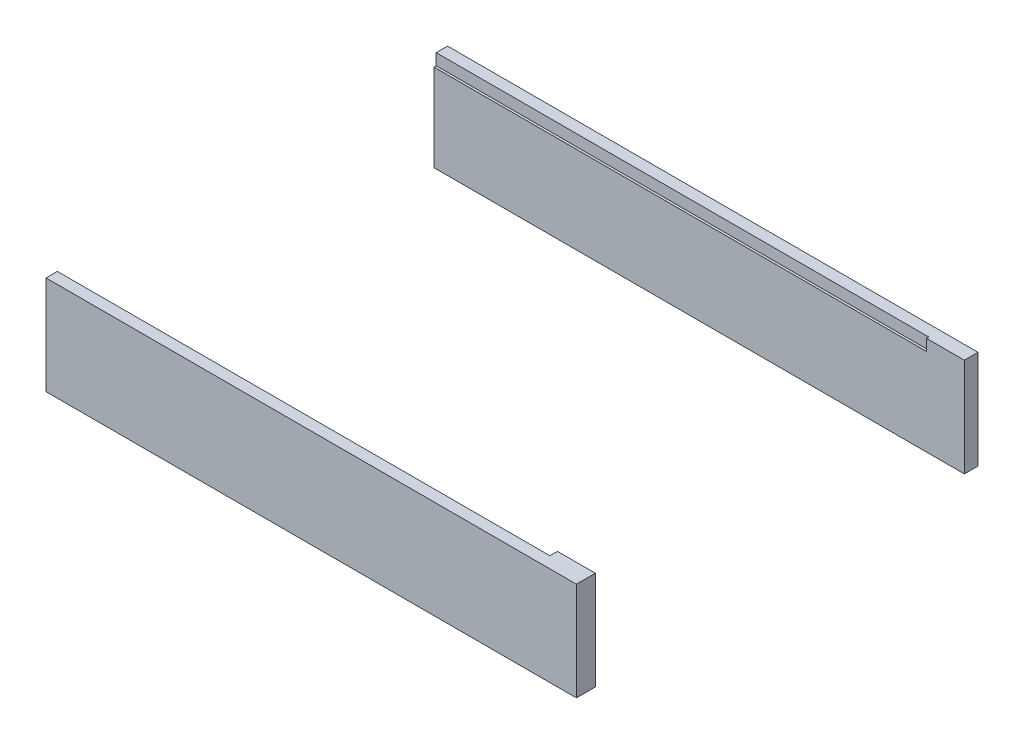
ISO-10303-21;
HEADER;
FILE_DESCRIPTION(('STEP AP214'),'2;1');
FILE_NAME('part.step','',(''),(''),'','','');
FILE_SCHEMA(('AUTOMOTIVE_DESIGN { 1 0 10303 214 1 1 1 1 }'));
ENDSEC;
DATA;
#1=APPLICATION_CONTEXT('core data for automotive mechanical design processes');
#2=APPLICATION_PROTOCOL_DEFINITION('international standard','automotive_design',2000,#1);
#3=PRODUCT_CONTEXT('',#1,'mechanical');
#4=PRODUCT('Part','Part','',(#3));
#5=PRODUCT_RELATED_PRODUCT_CATEGORY('part','',(#4));
#6=PRODUCT_DEFINITION_FORMATION('','',#4);
#7=PRODUCT_DEFINITION_CONTEXT('part definition',#1,'design');
#8=PRODUCT_DEFINITION('design','',#6,#7);
#9=PRODUCT_DEFINITION_SHAPE('','',#8);
#10=(LENGTH_UNIT() NAMED_UNIT(*) SI_UNIT(.MILLI.,.METRE.));
#11=(NAMED_UNIT(*) PLANE_ANGLE_UNIT() SI_UNIT($,.RADIAN.));
#12=(NAMED_UNIT(*) SI_UNIT($,.STERADIAN.) SOLID_ANGLE_UNIT());
#13=UNCERTAINTY_MEASURE_WITH_UNIT(LENGTH_MEASURE(1.E-05),#10,'distance_accuracy_value','');
#14=(GEOMETRIC_REPRESENTATION_CONTEXT(3) GLOBAL_UNCERTAINTY_ASSIGNED_CONTEXT((#13)) GLOBAL_UNIT_ASSIGNED_CONTEXT((#10,
#11,#12)) REPRESENTATION_CONTEXT('',''));
#15=CARTESIAN_POINT('',(0.,0.,0.));
#16=DIRECTION('',(0.,0.,1.));
#17=DIRECTION('',(1.,0.,0.));
#18=AXIS2_PLACEMENT_3D('',#15,#16,#17);
#19=CARTESIAN_POINT('',(-39.811320754717,13.,50.2641509433962));
#20=DIRECTION('',(1.,0.,0.));
#21=DIRECTION('',(0.,0.,-1.));
#22=AXIS2_PLACEMENT_3D('',#19,#20,#21);
#23=PLANE('',#22);
#24=DIRECTION('',(0.,0.,1.));
#25=VECTOR('',#24,1.);
#26=CARTESIAN_POINT('',(-39.811320754717,13.,50.2641509433962));
#27=LINE('',#26,#25);
#28=CARTESIAN_POINT('',(-39.811320754717,13.,48.7641509433962));
#29=VERTEX_POINT('',#28);
#30=CARTESIAN_POINT('',(-39.811320754717,13.,50.2641509433962));
#31=VERTEX_POINT('',#30);
#32=EDGE_CURVE('E98',#29,#31,#27,.T.);
#33=ORIENTED_EDGE('',*,*,#32,.F.);
#34=DIRECTION('',(0.,1.,0.));
#35=VECTOR('',#34,1.);
#36=CARTESIAN_POINT('',(-39.811320754717,11.5,48.7641509433962));
#37=LINE('',#36,#35);
#38=CARTESIAN_POINT('',(-39.811320754717,11.5,48.7641509433962));
#39=VERTEX_POINT('',#38);
#40=EDGE_CURVE('E64',#39,#29,#37,.T.);
#41=ORIENTED_EDGE('',*,*,#40,.F.);
#42=DIRECTION('',(0.,0.,1.));
#43=VECTOR('',#42,1.);
#44=CARTESIAN_POINT('',(-39.811320754717,11.5,47.7641509433962));
#45=LINE('',#44,#43);
#46=CARTESIAN_POINT('',(-39.811320754717,11.5,47.7641509433962));
#47=VERTEX_POINT('',#46);
#48=EDGE_CURVE('E126',#47,#39,#45,.T.);
#49=ORIENTED_EDGE('',*,*,#48,.F.);
#50=DIRECTION('',(0.,-1.,0.));
#51=VECTOR('',#50,1.);
#52=CARTESIAN_POINT('',(-39.811320754717,13.,47.7641509433962));
#53=LINE('',#52,#51);
#54=CARTESIAN_POINT('',(-39.811320754717,0.,47.7641509433962));
#55=VERTEX_POINT('',#54);
#56=EDGE_CURVE('E94',#47,#55,#53,.T.);
#57=ORIENTED_EDGE('',*,*,#56,.T.);
#58=DIRECTION('',(0.,0.,1.));
#59=VECTOR('',#58,1.);
#60=CARTESIAN_POINT('',(-39.811320754717,0.,50.2641509433962));
#61=LINE('',#60,#59);
#62=CARTESIAN_POINT('',(-39.811320754717,0.,50.2641509433962));
#63=VERTEX_POINT('',#62);
#64=EDGE_CURVE('E155',#55,#63,#61,.T.);
#65=ORIENTED_EDGE('',*,*,#64,.T.);
#66=DIRECTION('',(0.,-1.,0.));
#67=VECTOR('',#66,1.);
#68=CARTESIAN_POINT('',(-39.811320754717,13.,50.2641509433962));
#69=LINE('',#68,#67);
#70=EDGE_CURVE('E12',#31,#63,#69,.T.);
#71=ORIENTED_EDGE('',*,*,#70,.F.);
#72=EDGE_LOOP('',(#33,#41,#49,#57,#65,#71));
#73=FACE_BOUND('',#72,.T.);
#74=ADVANCED_FACE('F49',(#73),#23,.F.);
#75=CARTESIAN_POINT('',(-39.811320754717,13.,50.2641509433962));
#76=DIRECTION('',(0.,0.,-1.));
#77=DIRECTION('',(-1.,0.,0.));
#78=AXIS2_PLACEMENT_3D('',#75,#76,#77);
#79=PLANE('',#78);
#80=DIRECTION('',(1.,0.,0.));
#81=VECTOR('',#80,1.);
#82=CARTESIAN_POINT('',(-39.811320754717,0.,50.2641509433962));
#83=LINE('',#82,#81);
#84=CARTESIAN_POINT('',(30.188679245283,0.,50.2641509433962));
#85=VERTEX_POINT('',#84);
#86=EDGE_CURVE('E158',#63,#85,#83,.T.);
#87=ORIENTED_EDGE('',*,*,#86,.T.);
#88=DIRECTION('',(0.,-1.,0.));
#89=VECTOR('',#88,1.);
#90=CARTESIAN_POINT('',(30.188679245283,13.,50.2641509433962));
#91=LINE('',#90,#89);
#92=CARTESIAN_POINT('',(30.188679245283,13.,50.2641509433962));
#93=VERTEX_POINT('',#92);
#94=EDGE_CURVE('E57',#93,#85,#91,.T.);
#95=ORIENTED_EDGE('',*,*,#94,.F.);
#96=DIRECTION('',(1.,0.,0.));
#97=VECTOR('',#96,1.);
#98=CARTESIAN_POINT('',(-39.811320754717,13.,50.2641509433962));
#99=LINE('',#98,#97);
#100=EDGE_CURVE('E146',#31,#93,#99,.T.);
#101=ORIENTED_EDGE('',*,*,#100,.F.);
#102=ORIENTED_EDGE('',*,*,#70,.T.);
#103=EDGE_LOOP('',(#87,#95,#101,#102));
#104=FACE_BOUND('',#103,.T.);
#105=ADVANCED_FACE('F208',(#104),#79,.F.);
#106=CARTESIAN_POINT('',(30.188679245283,13.,50.2641509433962));
#107=DIRECTION('',(-1.,0.,0.));
#108=DIRECTION('',(0.,0.,1.));
#109=AXIS2_PLACEMENT_3D('',#106,#107,#108);
#110=PLANE('',#109);
#111=DIRECTION('',(0.,0.,-1.));
#112=VECTOR('',#111,1.);
#113=CARTESIAN_POINT('',(30.188679245283,0.,50.2641509433962));
#114=LINE('',#113,#112);
#115=CARTESIAN_POINT('',(30.188679245283,0.,47.7641509433962));
#116=VERTEX_POINT('',#115);
#117=EDGE_CURVE('E161',#85,#116,#114,.T.);
#118=ORIENTED_EDGE('',*,*,#117,.T.);
#119=DIRECTION('',(0.,-1.,0.));
#120=VECTOR('',#119,1.);
#121=CARTESIAN_POINT('',(30.188679245283,13.,47.7641509433962));
#122=LINE('',#121,#120);
#123=CARTESIAN_POINT('',(30.188679245283,13.,47.7641509433962));
#124=VERTEX_POINT('',#123);
#125=EDGE_CURVE('E168',#124,#116,#122,.T.);
#126=ORIENTED_EDGE('',*,*,#125,.F.);
#127=DIRECTION('',(0.,0.,-1.));
#128=VECTOR('',#127,1.);
#129=CARTESIAN_POINT('',(30.188679245283,13.,50.2641509433962));
#130=LINE('',#129,#128);
#131=EDGE_CURVE('E73',#93,#124,#130,.T.);
#132=ORIENTED_EDGE('',*,*,#131,.F.);
#133=ORIENTED_EDGE('',*,*,#94,.T.);
#134=EDGE_LOOP('',(#118,#126,#132,#133));
#135=FACE_BOUND('',#134,.T.);
#136=ADVANCED_FACE('F176',(#135),#110,.F.);
#137=CARTESIAN_POINT('',(-39.811320754717,13.,47.7641509433962));
#138=DIRECTION('',(0.,0.,1.));
#139=DIRECTION('',(1.,0.,0.));
#140=AXIS2_PLACEMENT_3D('',#137,#138,#139);
#141=PLANE('',#140);
#142=DIRECTION('',(-1.,0.,0.));
#143=VECTOR('',#142,1.);
#144=CARTESIAN_POINT('',(-39.811320754717,11.5,47.7641509433962));
#145=LINE('',#144,#143);
#146=CARTESIAN_POINT('',(25.188679245283,11.5,47.7641509433962));
#147=VERTEX_POINT('',#146);
#148=EDGE_CURVE('E130',#147,#47,#145,.T.);
#149=ORIENTED_EDGE('',*,*,#148,.F.);
#150=DIRECTION('',(0.,1.,0.));
#151=VECTOR('',#150,1.);
#152=CARTESIAN_POINT('',(25.188679245283,11.5,47.7641509433962));
#153=LINE('',#152,#151);
#154=CARTESIAN_POINT('',(25.188679245283,13.,47.7641509433962));
#155=VERTEX_POINT('',#154);
#156=EDGE_CURVE('E139',#147,#155,#153,.T.);
#157=ORIENTED_EDGE('',*,*,#156,.T.);
#158=DIRECTION('',(-1.,0.,0.));
#159=VECTOR('',#158,1.);
#160=CARTESIAN_POINT('',(-39.811320754717,13.,47.7641509433962));
#161=LINE('',#160,#159);
#162=EDGE_CURVE('E152',#124,#155,#161,.T.);
#163=ORIENTED_EDGE('',*,*,#162,.F.);
#164=ORIENTED_EDGE('',*,*,#125,.T.);
#165=DIRECTION('',(-1.,0.,0.));
#166=VECTOR('',#165,1.);
#167=CARTESIAN_POINT('',(-39.811320754717,0.,47.7641509433962));
#168=LINE('',#167,#166);
#169=EDGE_CURVE('E147',#116,#55,#168,.T.);
#170=ORIENTED_EDGE('',*,*,#169,.T.);
#171=ORIENTED_EDGE('',*,*,#56,.F.);
#172=EDGE_LOOP('',(#149,#157,#163,#164,#170,#171));
#173=FACE_BOUND('',#172,.T.);
#174=ADVANCED_FACE('F183',(#173),#141,.F.);
#175=CARTESIAN_POINT('',(0.,13.,0.));
#176=DIRECTION('',(0.,-1.,0.));
#177=DIRECTION('',(0.,0.,-1.));
#178=AXIS2_PLACEMENT_3D('',#175,#176,#177);
#179=PLANE('',#178);
#180=ORIENTED_EDGE('',*,*,#162,.T.);
#181=DIRECTION('',(0.,0.,-1.));
#182=VECTOR('',#181,1.);
#183=CARTESIAN_POINT('',(25.188679245283,13.,47.7641509433962));
#184=LINE('',#183,#182);
#185=CARTESIAN_POINT('',(25.188679245283,13.,48.7641509433962));
#186=VERTEX_POINT('',#185);
#187=EDGE_CURVE('E132',#186,#155,#184,.T.);
#188=ORIENTED_EDGE('',*,*,#187,.F.);
#189=DIRECTION('',(1.,0.,0.));
#190=VECTOR('',#189,1.);
#191=CARTESIAN_POINT('',(-39.811320754717,13.,48.7641509433962));
#192=LINE('',#191,#190);
#193=EDGE_CURVE('E188',#29,#186,#192,.T.);
#194=ORIENTED_EDGE('',*,*,#193,.F.);
#195=ORIENTED_EDGE('',*,*,#32,.T.);
#196=ORIENTED_EDGE('',*,*,#100,.T.);
#197=ORIENTED_EDGE('',*,*,#131,.T.);
#198=EDGE_LOOP('',(#180,#188,#194,#195,#196,#197));
#199=FACE_BOUND('',#198,.T.);
#200=ADVANCED_FACE('F187',(#199),#179,.F.);
#201=CARTESIAN_POINT('',(0.,0.,0.));
#202=DIRECTION('',(0.,-1.,0.));
#203=DIRECTION('',(0.,0.,-1.));
#204=AXIS2_PLACEMENT_3D('',#201,#202,#203);
#205=PLANE('',#204);
#206=ORIENTED_EDGE('',*,*,#64,.F.);
#207=ORIENTED_EDGE('',*,*,#169,.F.);
#208=ORIENTED_EDGE('',*,*,#117,.F.);
#209=ORIENTED_EDGE('',*,*,#86,.F.);
#210=EDGE_LOOP('',(#206,#207,#208,#209));
#211=FACE_BOUND('',#210,.T.);
#212=ADVANCED_FACE('F181',(#211),#205,.T.);
#213=CARTESIAN_POINT('',(25.188679245283,11.5,47.7641509433962));
#214=DIRECTION('',(1.,0.,0.));
#215=DIRECTION('',(0.,0.,-1.));
#216=AXIS2_PLACEMENT_3D('',#213,#214,#215);
#217=PLANE('',#216);
#218=ORIENTED_EDGE('',*,*,#187,.T.);
#219=ORIENTED_EDGE('',*,*,#156,.F.);
#220=DIRECTION('',(0.,0.,-1.));
#221=VECTOR('',#220,1.);
#222=CARTESIAN_POINT('',(25.188679245283,11.5,47.7641509433962));
#223=LINE('',#222,#221);
#224=CARTESIAN_POINT('',(25.188679245283,11.5,48.7641509433962));
#225=VERTEX_POINT('',#224);
#226=EDGE_CURVE('E125',#225,#147,#223,.T.);
#227=ORIENTED_EDGE('',*,*,#226,.F.);
#228=DIRECTION('',(0.,1.,0.));
#229=VECTOR('',#228,1.);
#230=CARTESIAN_POINT('',(25.188679245283,11.5,48.7641509433962));
#231=LINE('',#230,#229);
#232=EDGE_CURVE('E120',#225,#186,#231,.T.);
#233=ORIENTED_EDGE('',*,*,#232,.T.);
#234=EDGE_LOOP('',(#218,#219,#227,#233));
#235=FACE_BOUND('',#234,.T.);
#236=ADVANCED_FACE('F197',(#235),#217,.F.);
#237=CARTESIAN_POINT('',(-39.811320754717,11.5,48.7641509433962));
#238=DIRECTION('',(0.,0.,1.));
#239=DIRECTION('',(1.,0.,0.));
#240=AXIS2_PLACEMENT_3D('',#237,#238,#239);
#241=PLANE('',#240);
#242=ORIENTED_EDGE('',*,*,#193,.T.);
#243=ORIENTED_EDGE('',*,*,#232,.F.);
#244=DIRECTION('',(1.,0.,0.));
#245=VECTOR('',#244,1.);
#246=CARTESIAN_POINT('',(-39.811320754717,11.5,48.7641509433962));
#247=LINE('',#246,#245);
#248=EDGE_CURVE('E117',#39,#225,#247,.T.);
#249=ORIENTED_EDGE('',*,*,#248,.F.);
#250=ORIENTED_EDGE('',*,*,#40,.T.);
#251=EDGE_LOOP('',(#242,#243,#249,#250));
#252=FACE_BOUND('',#251,.T.);
#253=ADVANCED_FACE('F119',(#252),#241,.F.);
#254=CARTESIAN_POINT('',(0.,11.5,0.));
#255=DIRECTION('',(0.,1.,0.));
#256=DIRECTION('',(0.,0.,1.));
#257=AXIS2_PLACEMENT_3D('',#254,#255,#256);
#258=PLANE('',#257);
#259=ORIENTED_EDGE('',*,*,#48,.T.);
#260=ORIENTED_EDGE('',*,*,#248,.T.);
#261=ORIENTED_EDGE('',*,*,#226,.T.);
#262=ORIENTED_EDGE('',*,*,#148,.T.);
#263=EDGE_LOOP('',(#259,#260,#261,#262));
#264=FACE_BOUND('',#263,.T.);
#265=ADVANCED_FACE('F128',(#264),#258,.T.);
#266=CLOSED_SHELL('',(#74,#105,#136,#174,#200,#212,#236,#253,#265));
#267=MANIFOLD_SOLID_BREP('B2',#266);
#268=CARTESIAN_POINT('',(-39.811320754717,13.,-2.73584905660378));
#269=DIRECTION('',(1.,0.,0.));
#270=DIRECTION('',(0.,0.,-1.));
#271=AXIS2_PLACEMENT_3D('',#268,#269,#270);
#272=PLANE('',#271);
#273=DIRECTION('',(0.,0.,1.));
#274=VECTOR('',#273,1.);
#275=CARTESIAN_POINT('',(-39.811320754717,11.5,-0.935849056603776));
#276=LINE('',#275,#274);
#277=CARTESIAN_POINT('',(-39.811320754717,11.5,-1.23584905660378));
#278=VERTEX_POINT('',#277);
#279=CARTESIAN_POINT('',(-39.811320754717,11.5,-0.935849056603776));
#280=VERTEX_POINT('',#279);
#281=EDGE_CURVE('E340',#278,#280,#276,.T.);
#282=ORIENTED_EDGE('',*,*,#281,.F.);
#283=DIRECTION('',(0.,1.,0.));
#284=VECTOR('',#283,1.);
#285=CARTESIAN_POINT('',(-39.811320754717,11.5,-1.23584905660378));
#286=LINE('',#285,#284);
#287=CARTESIAN_POINT('',(-39.811320754717,13.,-1.23584905660378));
#288=VERTEX_POINT('',#287);
#289=EDGE_CURVE('E364',#278,#288,#286,.T.);
#290=ORIENTED_EDGE('',*,*,#289,.T.);
#291=DIRECTION('',(0.,0.,1.));
#292=VECTOR('',#291,1.);
#293=CARTESIAN_POINT('',(-39.811320754717,13.,-2.73584905660378));
#294=LINE('',#293,#292);
#295=CARTESIAN_POINT('',(-39.811320754717,13.,-2.73584905660378));
#296=VERTEX_POINT('',#295);
#297=EDGE_CURVE('E375',#296,#288,#294,.T.);
#298=ORIENTED_EDGE('',*,*,#297,.F.);
#299=DIRECTION('',(0.,-1.,0.));
#300=VECTOR('',#299,1.);
#301=CARTESIAN_POINT('',(-39.811320754717,13.,-2.73584905660378));
#302=LINE('',#301,#300);
#303=CARTESIAN_POINT('',(-39.811320754717,0.,-2.73584905660378));
#304=VERTEX_POINT('',#303);
#305=EDGE_CURVE('E361',#296,#304,#302,.T.);
#306=ORIENTED_EDGE('',*,*,#305,.T.);
#307=DIRECTION('',(0.,0.,1.));
#308=VECTOR('',#307,1.);
#309=CARTESIAN_POINT('',(-39.811320754717,0.,-2.73584905660378));
#310=LINE('',#309,#308);
#311=CARTESIAN_POINT('',(-39.811320754717,0.,-0.935849056603776));
#312=VERTEX_POINT('',#311);
#313=EDGE_CURVE('E359',#304,#312,#310,.T.);
#314=ORIENTED_EDGE('',*,*,#313,.T.);
#315=DIRECTION('',(0.,-1.,0.));
#316=VECTOR('',#315,1.);
#317=CARTESIAN_POINT('',(-39.811320754717,13.,-0.935849056603776));
#318=LINE('',#317,#316);
#319=EDGE_CURVE('E47',#280,#312,#318,.T.);
#320=ORIENTED_EDGE('',*,*,#319,.F.);
#321=EDGE_LOOP('',(#282,#290,#298,#306,#314,#320));
#322=FACE_BOUND('',#321,.T.);
#323=ADVANCED_FACE('F272',(#322),#272,.F.);
#324=CARTESIAN_POINT('',(-39.811320754717,13.,-0.935849056603776));
#325=DIRECTION('',(0.,0.,-1.));
#326=DIRECTION('',(-1.,0.,0.));
#327=AXIS2_PLACEMENT_3D('',#324,#325,#326);
#328=PLANE('',#327);
#329=DIRECTION('',(1.,0.,0.));
#330=VECTOR('',#329,1.);
#331=CARTESIAN_POINT('',(-39.811320754717,13.,-0.935849056603776));
#332=LINE('',#331,#330);
#333=CARTESIAN_POINT('',(25.188679245283,13.,-0.935849056603776));
#334=VERTEX_POINT('',#333);
#335=CARTESIAN_POINT('',(30.188679245283,13.,-0.935849056603776));
#336=VERTEX_POINT('',#335);
#337=EDGE_CURVE('E318',#334,#336,#332,.T.);
#338=ORIENTED_EDGE('',*,*,#337,.F.);
#339=DIRECTION('',(0.,1.,0.));
#340=VECTOR('',#339,1.);
#341=CARTESIAN_POINT('',(25.188679245283,11.5,-0.935849056603776));
#342=LINE('',#341,#340);
#343=CARTESIAN_POINT('',(25.188679245283,11.5,-0.935849056603776));
#344=VERTEX_POINT('',#343);
#345=EDGE_CURVE('E286',#344,#334,#342,.T.);
#346=ORIENTED_EDGE('',*,*,#345,.F.);
#347=DIRECTION('',(1.,0.,0.));
#348=VECTOR('',#347,1.);
#349=CARTESIAN_POINT('',(-39.811320754717,11.5,-0.935849056603776));
#350=LINE('',#349,#348);
#351=EDGE_CURVE('E344',#280,#344,#350,.T.);
#352=ORIENTED_EDGE('',*,*,#351,.F.);
#353=ORIENTED_EDGE('',*,*,#319,.T.);
#354=DIRECTION('',(1.,0.,0.));
#355=VECTOR('',#354,1.);
#356=CARTESIAN_POINT('',(-39.811320754717,0.,-0.935849056603776));
#357=LINE('',#356,#355);
#358=CARTESIAN_POINT('',(30.188679245283,0.,-0.935849056603776));
#359=VERTEX_POINT('',#358);
#360=EDGE_CURVE('E363',#312,#359,#357,.T.);
#361=ORIENTED_EDGE('',*,*,#360,.T.);
#362=DIRECTION('',(0.,-1.,0.));
#363=VECTOR('',#362,1.);
#364=CARTESIAN_POINT('',(30.188679245283,13.,-0.935849056603776));
#365=LINE('',#364,#363);
#366=EDGE_CURVE('E279',#336,#359,#365,.T.);
#367=ORIENTED_EDGE('',*,*,#366,.F.);
#368=EDGE_LOOP('',(#338,#346,#352,#353,#361,#367));
#369=FACE_BOUND('',#368,.T.);
#370=ADVANCED_FACE('F353',(#369),#328,.F.);
#371=CARTESIAN_POINT('',(30.188679245283,13.,-2.73584905660378));
#372=DIRECTION('',(-1.,0.,0.));
#373=DIRECTION('',(0.,0.,1.));
#374=AXIS2_PLACEMENT_3D('',#371,#372,#373);
#375=PLANE('',#374);
#376=DIRECTION('',(0.,0.,-1.));
#377=VECTOR('',#376,1.);
#378=CARTESIAN_POINT('',(30.188679245283,0.,-2.73584905660378));
#379=LINE('',#378,#377);
#380=CARTESIAN_POINT('',(30.188679245283,0.,-2.73584905660378));
#381=VERTEX_POINT('',#380);
#382=EDGE_CURVE('E366',#359,#381,#379,.T.);
#383=ORIENTED_EDGE('',*,*,#382,.T.);
#384=DIRECTION('',(0.,-1.,0.));
#385=VECTOR('',#384,1.);
#386=CARTESIAN_POINT('',(30.188679245283,13.,-2.73584905660378));
#387=LINE('',#386,#385);
#388=CARTESIAN_POINT('',(30.188679245283,13.,-2.73584905660378));
#389=VERTEX_POINT('',#388);
#390=EDGE_CURVE('E377',#389,#381,#387,.T.);
#391=ORIENTED_EDGE('',*,*,#390,.F.);
#392=DIRECTION('',(0.,0.,-1.));
#393=VECTOR('',#392,1.);
#394=CARTESIAN_POINT('',(30.188679245283,13.,-2.73584905660378));
#395=LINE('',#394,#393);
#396=EDGE_CURVE('E384',#336,#389,#395,.T.);
#397=ORIENTED_EDGE('',*,*,#396,.F.);
#398=ORIENTED_EDGE('',*,*,#366,.T.);
#399=EDGE_LOOP('',(#383,#391,#397,#398));
#400=FACE_BOUND('',#399,.T.);
#401=ADVANCED_FACE('F382',(#400),#375,.F.);
#402=CARTESIAN_POINT('',(-39.811320754717,13.,-2.73584905660378));
#403=DIRECTION('',(0.,0.,1.));
#404=DIRECTION('',(1.,0.,0.));
#405=AXIS2_PLACEMENT_3D('',#402,#403,#404);
#406=PLANE('',#405);
#407=DIRECTION('',(-1.,0.,0.));
#408=VECTOR('',#407,1.);
#409=CARTESIAN_POINT('',(-39.811320754717,0.,-2.73584905660378));
#410=LINE('',#409,#408);
#411=EDGE_CURVE('E314',#381,#304,#410,.T.);
#412=ORIENTED_EDGE('',*,*,#411,.T.);
#413=ORIENTED_EDGE('',*,*,#305,.F.);
#414=DIRECTION('',(-1.,0.,0.));
#415=VECTOR('',#414,1.);
#416=CARTESIAN_POINT('',(-39.811320754717,13.,-2.73584905660378));
#417=LINE('',#416,#415);
#418=EDGE_CURVE('E295',#389,#296,#417,.T.);
#419=ORIENTED_EDGE('',*,*,#418,.F.);
#420=ORIENTED_EDGE('',*,*,#390,.T.);
#421=EDGE_LOOP('',(#412,#413,#419,#420));
#422=FACE_BOUND('',#421,.T.);
#423=ADVANCED_FACE('F397',(#422),#406,.F.);
#424=CARTESIAN_POINT('',(0.,13.,0.));
#425=DIRECTION('',(0.,1.,0.));
#426=DIRECTION('',(0.,0.,1.));
#427=AXIS2_PLACEMENT_3D('',#424,#425,#426);
#428=PLANE('',#427);
#429=DIRECTION('',(-1.,0.,0.));
#430=VECTOR('',#429,1.);
#431=CARTESIAN_POINT('',(-39.811320754717,13.,-1.23584905660378));
#432=LINE('',#431,#430);
#433=CARTESIAN_POINT('',(25.188679245283,13.,-1.23584905660378));
#434=VERTEX_POINT('',#433);
#435=EDGE_CURVE('E350',#434,#288,#432,.T.);
#436=ORIENTED_EDGE('',*,*,#435,.F.);
#437=DIRECTION('',(0.,0.,-1.));
#438=VECTOR('',#437,1.);
#439=CARTESIAN_POINT('',(25.188679245283,13.,-0.935849056603776));
#440=LINE('',#439,#438);
#441=EDGE_CURVE('E446',#334,#434,#440,.T.);
#442=ORIENTED_EDGE('',*,*,#441,.F.);
#443=ORIENTED_EDGE('',*,*,#337,.T.);
#444=ORIENTED_EDGE('',*,*,#396,.T.);
#445=ORIENTED_EDGE('',*,*,#418,.T.);
#446=ORIENTED_EDGE('',*,*,#297,.T.);
#447=EDGE_LOOP('',(#436,#442,#443,#444,#445,#446));
#448=FACE_BOUND('',#447,.T.);
#449=ADVANCED_FACE('F388',(#448),#428,.T.);
#450=CARTESIAN_POINT('',(0.,0.,0.));
#451=DIRECTION('',(0.,1.,0.));
#452=DIRECTION('',(0.,0.,1.));
#453=AXIS2_PLACEMENT_3D('',#450,#451,#452);
#454=PLANE('',#453);
#455=ORIENTED_EDGE('',*,*,#313,.F.);
#456=ORIENTED_EDGE('',*,*,#411,.F.);
#457=ORIENTED_EDGE('',*,*,#382,.F.);
#458=ORIENTED_EDGE('',*,*,#360,.F.);
#459=EDGE_LOOP('',(#455,#456,#457,#458));
#460=FACE_BOUND('',#459,.T.);
#461=ADVANCED_FACE('F385',(#460),#454,.F.);
#462=CARTESIAN_POINT('',(-39.811320754717,11.5,-1.23584905660378));
#463=DIRECTION('',(0.,0.,-1.));
#464=DIRECTION('',(-1.,0.,0.));
#465=AXIS2_PLACEMENT_3D('',#462,#463,#464);
#466=PLANE('',#465);
#467=ORIENTED_EDGE('',*,*,#435,.T.);
#468=ORIENTED_EDGE('',*,*,#289,.F.);
#469=DIRECTION('',(-1.,0.,0.));
#470=VECTOR('',#469,1.);
#471=CARTESIAN_POINT('',(-39.811320754717,11.5,-1.23584905660378));
#472=LINE('',#471,#470);
#473=CARTESIAN_POINT('',(25.188679245283,11.5,-1.23584905660378));
#474=VERTEX_POINT('',#473);
#475=EDGE_CURVE('E346',#474,#278,#472,.T.);
#476=ORIENTED_EDGE('',*,*,#475,.F.);
#477=DIRECTION('',(0.,1.,0.));
#478=VECTOR('',#477,1.);
#479=CARTESIAN_POINT('',(25.188679245283,11.5,-1.23584905660378));
#480=LINE('',#479,#478);
#481=EDGE_CURVE('E368',#474,#434,#480,.T.);
#482=ORIENTED_EDGE('',*,*,#481,.T.);
#483=EDGE_LOOP('',(#467,#468,#476,#482));
#484=FACE_BOUND('',#483,.T.);
#485=ADVANCED_FACE('F387',(#484),#466,.F.);
#486=CARTESIAN_POINT('',(25.188679245283,11.5,-0.935849056603776));
#487=DIRECTION('',(1.,0.,0.));
#488=DIRECTION('',(0.,0.,-1.));
#489=AXIS2_PLACEMENT_3D('',#486,#487,#488);
#490=PLANE('',#489);
#491=ORIENTED_EDGE('',*,*,#441,.T.);
#492=ORIENTED_EDGE('',*,*,#481,.F.);
#493=DIRECTION('',(0.,0.,-1.));
#494=VECTOR('',#493,1.);
#495=CARTESIAN_POINT('',(25.188679245283,11.5,-0.935849056603776));
#496=LINE('',#495,#494);
#497=EDGE_CURVE('E355',#344,#474,#496,.T.);
#498=ORIENTED_EDGE('',*,*,#497,.F.);
#499=ORIENTED_EDGE('',*,*,#345,.T.);
#500=EDGE_LOOP('',(#491,#492,#498,#499));
#501=FACE_BOUND('',#500,.T.);
#502=ADVANCED_FACE('F394',(#501),#490,.F.);
#503=CARTESIAN_POINT('',(0.,11.5,0.));
#504=DIRECTION('',(0.,-1.,0.));
#505=DIRECTION('',(0.,0.,-1.));
#506=AXIS2_PLACEMENT_3D('',#503,#504,#505);
#507=PLANE('',#506);
#508=ORIENTED_EDGE('',*,*,#281,.T.);
#509=ORIENTED_EDGE('',*,*,#351,.T.);
#510=ORIENTED_EDGE('',*,*,#497,.T.);
#511=ORIENTED_EDGE('',*,*,#475,.T.);
#512=EDGE_LOOP('',(#508,#509,#510,#511));
#513=FACE_BOUND('',#512,.T.);
#514=ADVANCED_FACE('F342',(#513),#507,.F.);
#515=CLOSED_SHELL('',(#323,#370,#401,#423,#449,#461,#485,#502,#514));
#516=MANIFOLD_SOLID_BREP('B6',#515);
#517=ADVANCED_BREP_SHAPE_REPRESENTATION('',(#18,#267,#516),#14);
#518=SHAPE_DEFINITION_REPRESENTATION(#9,#517);
ENDSEC;
END-ISO-10303-21;
